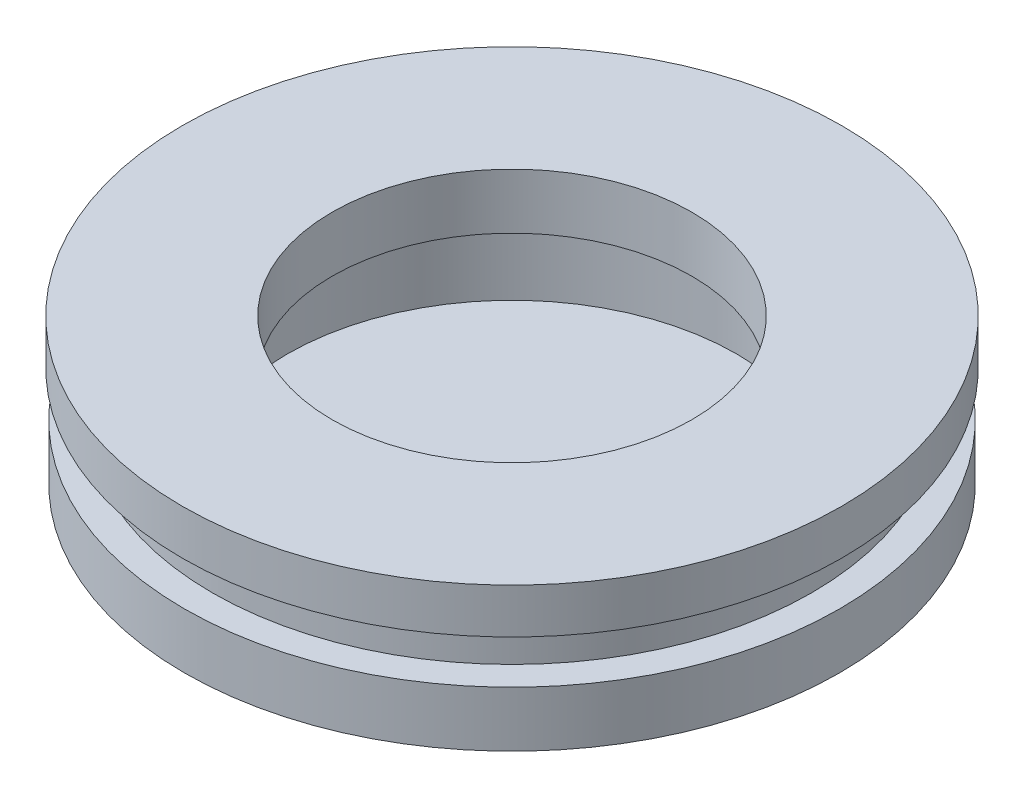
ISO-10303-21;
HEADER;
FILE_DESCRIPTION(('STEP AP214'),'2;1');
FILE_NAME('part.step','',(''),(''),'','','');
FILE_SCHEMA(('AUTOMOTIVE_DESIGN { 1 0 10303 214 1 1 1 1 }'));
ENDSEC;
DATA;
#1=APPLICATION_CONTEXT('core data for automotive mechanical design processes');
#2=APPLICATION_PROTOCOL_DEFINITION('international standard','automotive_design',2000,#1);
#3=PRODUCT_CONTEXT('',#1,'mechanical');
#4=PRODUCT('Part','Part','',(#3));
#5=PRODUCT_RELATED_PRODUCT_CATEGORY('part','',(#4));
#6=PRODUCT_DEFINITION_FORMATION('','',#4);
#7=PRODUCT_DEFINITION_CONTEXT('part definition',#1,'design');
#8=PRODUCT_DEFINITION('design','',#6,#7);
#9=PRODUCT_DEFINITION_SHAPE('','',#8);
#10=(LENGTH_UNIT() NAMED_UNIT(*) SI_UNIT(.MILLI.,.METRE.));
#11=(NAMED_UNIT(*) PLANE_ANGLE_UNIT() SI_UNIT($,.RADIAN.));
#12=(NAMED_UNIT(*) SI_UNIT($,.STERADIAN.) SOLID_ANGLE_UNIT());
#13=UNCERTAINTY_MEASURE_WITH_UNIT(LENGTH_MEASURE(1.E-05),#10,'distance_accuracy_value','');
#14=(GEOMETRIC_REPRESENTATION_CONTEXT(3) GLOBAL_UNCERTAINTY_ASSIGNED_CONTEXT((#13)) GLOBAL_UNIT_ASSIGNED_CONTEXT((#10,
#11,#12)) REPRESENTATION_CONTEXT('',''));
#15=CARTESIAN_POINT('',(0.,0.,0.));
#16=DIRECTION('',(0.,0.,1.));
#17=DIRECTION('',(1.,0.,0.));
#18=AXIS2_PLACEMENT_3D('',#15,#16,#17);
#19=CARTESIAN_POINT('',(0.,3.97802918922809,0.));
#20=DIRECTION('',(0.,1.,0.));
#21=DIRECTION('',(-1.,0.,0.));
#22=AXIS2_PLACEMENT_3D('',#19,#20,#21);
#23=CONICAL_SURFACE('',#22,10.9295453713358,1.22173047639604);
#24=CARTESIAN_POINT('',(0.,0.,0.));
#25=VERTEX_POINT('',#24);
#26=VERTEX_LOOP('',#25);
#27=FACE_BOUND('',#26,.T.);
#28=CARTESIAN_POINT('',(0.,3.97802918922809,0.));
#29=DIRECTION('',(0.,-1.,0.));
#30=DIRECTION('',(1.,0.,0.));
#31=AXIS2_PLACEMENT_3D('',#28,#29,#30);
#32=CIRCLE('',#31,10.9295453713358);
#33=CARTESIAN_POINT('',(10.9295453713358,3.97802918922808,0.));
#34=VERTEX_POINT('',#33);
#35=EDGE_CURVE('E48',#34,#34,#32,.T.);
#36=ORIENTED_EDGE('',*,*,#35,.T.);
#37=EDGE_LOOP('',(#36));
#38=FACE_BOUND('',#37,.T.);
#39=ADVANCED_FACE('F33',(#27,#38),#23,.T.);
#40=CARTESIAN_POINT('',(0.,8.82802918922809,0.));
#41=DIRECTION('',(0.,-1.,0.));
#42=DIRECTION('',(1.,0.,0.));
#43=AXIS2_PLACEMENT_3D('',#40,#41,#42);
#44=PLANE('',#43);
#45=CARTESIAN_POINT('',(0.,8.82802918922809,0.));
#46=DIRECTION('',(0.,-1.,0.));
#47=DIRECTION('',(1.,0.,0.));
#48=AXIS2_PLACEMENT_3D('',#45,#46,#47);
#49=CIRCLE('',#48,6.);
#50=CARTESIAN_POINT('',(6.,8.82802918922809,0.));
#51=VERTEX_POINT('',#50);
#52=EDGE_CURVE('E36',#51,#51,#49,.F.);
#53=ORIENTED_EDGE('',*,*,#52,.F.);
#54=EDGE_LOOP('',(#53));
#55=FACE_BOUND('',#54,.T.);
#56=CARTESIAN_POINT('',(0.,8.82802918922809,0.));
#57=DIRECTION('',(0.,-1.,0.));
#58=DIRECTION('',(1.,0.,0.));
#59=AXIS2_PLACEMENT_3D('',#56,#57,#58);
#60=CIRCLE('',#59,11.);
#61=CARTESIAN_POINT('',(11.,8.82802918922808,0.));
#62=VERTEX_POINT('',#61);
#63=EDGE_CURVE('E11',#62,#62,#60,.T.);
#64=ORIENTED_EDGE('',*,*,#63,.F.);
#65=EDGE_LOOP('',(#64));
#66=FACE_BOUND('',#65,.T.);
#67=ADVANCED_FACE('F45',(#55,#66),#44,.F.);
#68=CARTESIAN_POINT('',(0.,0.,0.));
#69=DIRECTION('',(0.,-1.,0.));
#70=DIRECTION('',(1.,0.,0.));
#71=AXIS2_PLACEMENT_3D('',#68,#69,#70);
#72=CYLINDRICAL_SURFACE('',#71,11.);
#73=CARTESIAN_POINT('',(0.,7.32802918922809,0.));
#74=DIRECTION('',(0.,-1.,0.));
#75=DIRECTION('',(1.,0.,0.));
#76=AXIS2_PLACEMENT_3D('',#73,#74,#75);
#77=CIRCLE('',#76,11.);
#78=CARTESIAN_POINT('',(11.,7.32802918922808,0.));
#79=VERTEX_POINT('',#78);
#80=EDGE_CURVE('E40',#79,#79,#77,.T.);
#81=ORIENTED_EDGE('',*,*,#80,.F.);
#82=EDGE_LOOP('',(#81));
#83=FACE_BOUND('',#82,.T.);
#84=ORIENTED_EDGE('',*,*,#63,.T.);
#85=EDGE_LOOP('',(#84));
#86=FACE_BOUND('',#85,.T.);
#87=ADVANCED_FACE('F70',(#83,#86),#72,.T.);
#88=CARTESIAN_POINT('',(-11.,7.32802918922809,0.));
#89=DIRECTION('',(0.,1.,0.));
#90=DIRECTION('',(-1.,0.,0.));
#91=AXIS2_PLACEMENT_3D('',#88,#89,#90);
#92=PLANE('',#91);
#93=CARTESIAN_POINT('',(0.,7.32802918922809,0.));
#94=DIRECTION('',(0.,-1.,0.));
#95=DIRECTION('',(1.,0.,0.));
#96=AXIS2_PLACEMENT_3D('',#93,#94,#95);
#97=CIRCLE('',#96,10.);
#98=CARTESIAN_POINT('',(10.,7.32802918922808,0.));
#99=VERTEX_POINT('',#98);
#100=EDGE_CURVE('E62',#99,#99,#97,.T.);
#101=ORIENTED_EDGE('',*,*,#100,.F.);
#102=EDGE_LOOP('',(#101));
#103=FACE_BOUND('',#102,.T.);
#104=ORIENTED_EDGE('',*,*,#80,.T.);
#105=EDGE_LOOP('',(#104));
#106=FACE_BOUND('',#105,.T.);
#107=ADVANCED_FACE('F68',(#103,#106),#92,.F.);
#108=CARTESIAN_POINT('',(0.,0.,0.));
#109=DIRECTION('',(0.,-1.,0.));
#110=DIRECTION('',(1.,0.,0.));
#111=AXIS2_PLACEMENT_3D('',#108,#109,#110);
#112=CYLINDRICAL_SURFACE('',#111,10.);
#113=CARTESIAN_POINT('',(0.,5.82802918922809,0.));
#114=DIRECTION('',(0.,-1.,0.));
#115=DIRECTION('',(1.,0.,0.));
#116=AXIS2_PLACEMENT_3D('',#113,#114,#115);
#117=CIRCLE('',#116,10.);
#118=CARTESIAN_POINT('',(10.,5.82802918922808,0.));
#119=VERTEX_POINT('',#118);
#120=EDGE_CURVE('E53',#119,#119,#117,.T.);
#121=ORIENTED_EDGE('',*,*,#120,.F.);
#122=EDGE_LOOP('',(#121));
#123=FACE_BOUND('',#122,.T.);
#124=ORIENTED_EDGE('',*,*,#100,.T.);
#125=EDGE_LOOP('',(#124));
#126=FACE_BOUND('',#125,.T.);
#127=ADVANCED_FACE('F84',(#123,#126),#112,.T.);
#128=CARTESIAN_POINT('',(-10.,5.82802918922809,0.));
#129=DIRECTION('',(0.,-1.,0.));
#130=DIRECTION('',(1.,0.,0.));
#131=AXIS2_PLACEMENT_3D('',#128,#129,#130);
#132=PLANE('',#131);
#133=CARTESIAN_POINT('',(0.,5.82802918922809,0.));
#134=DIRECTION('',(0.,-1.,0.));
#135=DIRECTION('',(1.,0.,0.));
#136=AXIS2_PLACEMENT_3D('',#133,#134,#135);
#137=CIRCLE('',#136,10.9295453713358);
#138=CARTESIAN_POINT('',(10.9295453713358,5.82802918922808,0.));
#139=VERTEX_POINT('',#138);
#140=EDGE_CURVE('E50',#139,#139,#137,.T.);
#141=ORIENTED_EDGE('',*,*,#140,.F.);
#142=EDGE_LOOP('',(#141));
#143=FACE_BOUND('',#142,.T.);
#144=ORIENTED_EDGE('',*,*,#120,.T.);
#145=EDGE_LOOP('',(#144));
#146=FACE_BOUND('',#145,.T.);
#147=ADVANCED_FACE('F88',(#143,#146),#132,.F.);
#148=CARTESIAN_POINT('',(0.,0.,0.));
#149=DIRECTION('',(0.,-1.,0.));
#150=DIRECTION('',(1.,0.,0.));
#151=AXIS2_PLACEMENT_3D('',#148,#149,#150);
#152=CYLINDRICAL_SURFACE('',#151,10.9295453713358);
#153=ORIENTED_EDGE('',*,*,#35,.F.);
#154=EDGE_LOOP('',(#153));
#155=FACE_BOUND('',#154,.T.);
#156=ORIENTED_EDGE('',*,*,#140,.T.);
#157=EDGE_LOOP('',(#156));
#158=FACE_BOUND('',#157,.T.);
#159=ADVANCED_FACE('F92',(#155,#158),#152,.T.);
#160=CARTESIAN_POINT('',(0.,3.97802918922809,0.));
#161=DIRECTION('',(0.,-1.,0.));
#162=DIRECTION('',(0.,0.,-1.));
#163=AXIS2_PLACEMENT_3D('',#160,#161,#162);
#164=CYLINDRICAL_SURFACE('',#163,6.);
#165=CARTESIAN_POINT('',(0.,6.97802918922809,0.));
#166=DIRECTION('',(0.,-1.,0.));
#167=DIRECTION('',(0.,0.,-1.));
#168=AXIS2_PLACEMENT_3D('',#165,#166,#167);
#169=CIRCLE('',#168,6.);
#170=CARTESIAN_POINT('',(0.,6.97802918922809,-6.));
#171=VERTEX_POINT('',#170);
#172=EDGE_CURVE('E56',#171,#171,#169,.T.);
#173=ORIENTED_EDGE('',*,*,#172,.T.);
#174=EDGE_LOOP('',(#173));
#175=FACE_BOUND('',#174,.T.);
#176=ORIENTED_EDGE('',*,*,#52,.T.);
#177=EDGE_LOOP('',(#176));
#178=FACE_BOUND('',#177,.T.);
#179=ADVANCED_FACE('F96',(#175,#178),#164,.F.);
#180=CARTESIAN_POINT('',(-7.5,3.97802918922809,0.));
#181=DIRECTION('',(0.,1.,0.));
#182=DIRECTION('',(0.,0.,1.));
#183=AXIS2_PLACEMENT_3D('',#180,#181,#182);
#184=PLANE('',#183);
#185=CARTESIAN_POINT('',(0.,3.97802918922809,0.));
#186=DIRECTION('',(0.,-1.,0.));
#187=DIRECTION('',(0.,0.,-1.));
#188=AXIS2_PLACEMENT_3D('',#185,#186,#187);
#189=CIRCLE('',#188,7.5);
#190=CARTESIAN_POINT('',(0.,3.97802918922809,-7.5));
#191=VERTEX_POINT('',#190);
#192=EDGE_CURVE('E116',#191,#191,#189,.T.);
#193=ORIENTED_EDGE('',*,*,#192,.F.);
#194=EDGE_LOOP('',(#193));
#195=FACE_BOUND('',#194,.T.);
#196=ADVANCED_FACE('F97',(#195),#184,.T.);
#197=CARTESIAN_POINT('',(-6.,6.97802918922809,0.));
#198=DIRECTION('',(0.,-1.,0.));
#199=DIRECTION('',(0.,0.,-1.));
#200=AXIS2_PLACEMENT_3D('',#197,#198,#199);
#201=PLANE('',#200);
#202=CARTESIAN_POINT('',(0.,6.97802918922809,0.));
#203=DIRECTION('',(0.,-1.,0.));
#204=DIRECTION('',(0.,0.,-1.));
#205=AXIS2_PLACEMENT_3D('',#202,#203,#204);
#206=CIRCLE('',#205,7.5);
#207=CARTESIAN_POINT('',(0.,6.97802918922809,-7.5));
#208=VERTEX_POINT('',#207);
#209=EDGE_CURVE('E119',#208,#208,#206,.T.);
#210=ORIENTED_EDGE('',*,*,#209,.T.);
#211=EDGE_LOOP('',(#210));
#212=FACE_BOUND('',#211,.T.);
#213=ORIENTED_EDGE('',*,*,#172,.F.);
#214=EDGE_LOOP('',(#213));
#215=FACE_BOUND('',#214,.T.);
#216=ADVANCED_FACE('F100',(#212,#215),#201,.T.);
#217=CARTESIAN_POINT('',(0.,3.97802918922809,0.));
#218=DIRECTION('',(0.,-1.,0.));
#219=DIRECTION('',(0.,0.,-1.));
#220=AXIS2_PLACEMENT_3D('',#217,#218,#219);
#221=CYLINDRICAL_SURFACE('',#220,7.5);
#222=ORIENTED_EDGE('',*,*,#192,.T.);
#223=EDGE_LOOP('',(#222));
#224=FACE_BOUND('',#223,.T.);
#225=ORIENTED_EDGE('',*,*,#209,.F.);
#226=EDGE_LOOP('',(#225));
#227=FACE_BOUND('',#226,.T.);
#228=ADVANCED_FACE('F107',(#224,#227),#221,.F.);
#229=CLOSED_SHELL('',(#39,#67,#87,#107,#127,#147,#159,#179,#196,#216,#228));
#230=MANIFOLD_SOLID_BREP('B2',#229);
#231=ADVANCED_BREP_SHAPE_REPRESENTATION('',(#18,#230),#14);
#232=SHAPE_DEFINITION_REPRESENTATION(#9,#231);
ENDSEC;
END-ISO-10303-21;
